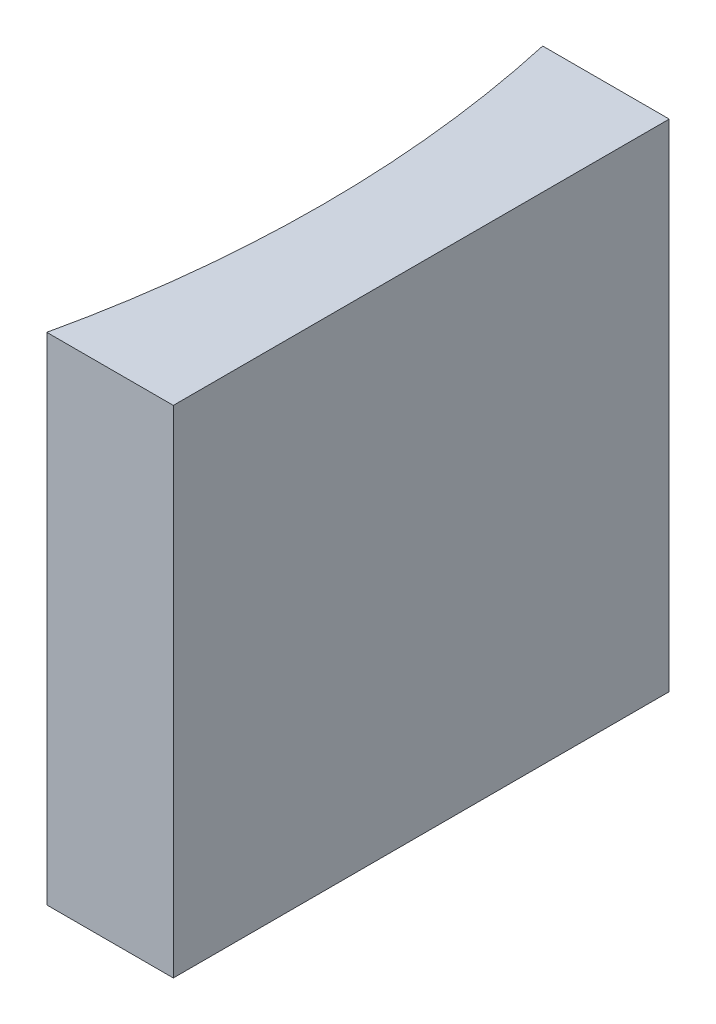
ISO-10303-21;
HEADER;
FILE_DESCRIPTION(('STEP AP214'),'2;1');
FILE_NAME('part.step','',(''),(''),'','','');
FILE_SCHEMA(('AUTOMOTIVE_DESIGN { 1 0 10303 214 1 1 1 1 }'));
ENDSEC;
DATA;
#1=APPLICATION_CONTEXT('core data for automotive mechanical design processes');
#2=APPLICATION_PROTOCOL_DEFINITION('international standard','automotive_design',2000,#1);
#3=PRODUCT_CONTEXT('',#1,'mechanical');
#4=PRODUCT('Part','Part','',(#3));
#5=PRODUCT_RELATED_PRODUCT_CATEGORY('part','',(#4));
#6=PRODUCT_DEFINITION_FORMATION('','',#4);
#7=PRODUCT_DEFINITION_CONTEXT('part definition',#1,'design');
#8=PRODUCT_DEFINITION('design','',#6,#7);
#9=PRODUCT_DEFINITION_SHAPE('','',#8);
#10=(LENGTH_UNIT() NAMED_UNIT(*) SI_UNIT(.MILLI.,.METRE.));
#11=(NAMED_UNIT(*) PLANE_ANGLE_UNIT() SI_UNIT($,.RADIAN.));
#12=(NAMED_UNIT(*) SI_UNIT($,.STERADIAN.) SOLID_ANGLE_UNIT());
#13=UNCERTAINTY_MEASURE_WITH_UNIT(LENGTH_MEASURE(1.E-05),#10,'distance_accuracy_value','');
#14=(GEOMETRIC_REPRESENTATION_CONTEXT(3) GLOBAL_UNCERTAINTY_ASSIGNED_CONTEXT((#13)) GLOBAL_UNIT_ASSIGNED_CONTEXT((#10,
#11,#12)) REPRESENTATION_CONTEXT('',''));
#15=CARTESIAN_POINT('',(0.,0.,0.));
#16=DIRECTION('',(0.,0.,1.));
#17=DIRECTION('',(1.,0.,0.));
#18=AXIS2_PLACEMENT_3D('',#15,#16,#17);
#19=CARTESIAN_POINT('',(0.,10.,0.));
#20=DIRECTION('',(0.,0.,1.));
#21=DIRECTION('',(1.,0.,0.));
#22=AXIS2_PLACEMENT_3D('',#19,#20,#21);
#23=PLANE('',#22);
#24=DIRECTION('',(-1.,0.,0.));
#25=VECTOR('',#24,1.);
#26=CARTESIAN_POINT('',(0.,0.,0.));
#27=LINE('',#26,#25);
#28=CARTESIAN_POINT('',(0.,0.,0.));
#29=VERTEX_POINT('',#28);
#30=CARTESIAN_POINT('',(-2.55202288985435,0.,0.));
#31=VERTEX_POINT('',#30);
#32=EDGE_CURVE('E100',#29,#31,#27,.T.);
#33=ORIENTED_EDGE('',*,*,#32,.T.);
#34=DIRECTION('',(0.,-1.,0.));
#35=VECTOR('',#34,1.);
#36=CARTESIAN_POINT('',(-2.55202288985435,10.,0.));
#37=LINE('',#36,#35);
#38=CARTESIAN_POINT('',(-2.55202288985435,10.,0.));
#39=VERTEX_POINT('',#38);
#40=EDGE_CURVE('E11',#39,#31,#37,.T.);
#41=ORIENTED_EDGE('',*,*,#40,.F.);
#42=DIRECTION('',(-1.,0.,0.));
#43=VECTOR('',#42,1.);
#44=CARTESIAN_POINT('',(0.,10.,0.));
#45=LINE('',#44,#43);
#46=CARTESIAN_POINT('',(0.,10.,0.));
#47=VERTEX_POINT('',#46);
#48=EDGE_CURVE('E88',#47,#39,#45,.T.);
#49=ORIENTED_EDGE('',*,*,#48,.F.);
#50=DIRECTION('',(0.,-1.,0.));
#51=VECTOR('',#50,1.);
#52=CARTESIAN_POINT('',(0.,10.,0.));
#53=LINE('',#52,#51);
#54=EDGE_CURVE('E96',#47,#29,#53,.T.);
#55=ORIENTED_EDGE('',*,*,#54,.T.);
#56=EDGE_LOOP('',(#33,#41,#49,#55));
#57=FACE_BOUND('',#56,.T.);
#58=ADVANCED_FACE('F37',(#57),#23,.F.);
#59=CARTESIAN_POINT('',(-24.92,10.,5.));
#60=DIRECTION('',(0.,-1.,0.));
#61=DIRECTION('',(0.,0.,-1.));
#62=AXIS2_PLACEMENT_3D('',#59,#60,#61);
#63=CYLINDRICAL_SURFACE('',#62,22.92);
#64=CARTESIAN_POINT('',(-24.92,0.,5.));
#65=DIRECTION('',(0.,-1.,0.));
#66=DIRECTION('',(0.,0.,1.));
#67=AXIS2_PLACEMENT_3D('',#64,#65,#66);
#68=CIRCLE('',#67,22.92);
#69=CARTESIAN_POINT('',(-2.55202288985434,0.,10.));
#70=VERTEX_POINT('',#69);
#71=EDGE_CURVE('E92',#31,#70,#68,.T.);
#72=ORIENTED_EDGE('',*,*,#71,.T.);
#73=DIRECTION('',(0.,-1.,0.));
#74=VECTOR('',#73,1.);
#75=CARTESIAN_POINT('',(-2.55202288985434,10.,10.));
#76=LINE('',#75,#74);
#77=CARTESIAN_POINT('',(-2.55202288985434,10.,10.));
#78=VERTEX_POINT('',#77);
#79=EDGE_CURVE('E45',#78,#70,#76,.T.);
#80=ORIENTED_EDGE('',*,*,#79,.F.);
#81=CARTESIAN_POINT('',(-24.92,10.,5.));
#82=DIRECTION('',(0.,-1.,0.));
#83=DIRECTION('',(0.,0.,1.));
#84=AXIS2_PLACEMENT_3D('',#81,#82,#83);
#85=CIRCLE('',#84,22.92);
#86=EDGE_CURVE('E83',#39,#78,#85,.T.);
#87=ORIENTED_EDGE('',*,*,#86,.F.);
#88=ORIENTED_EDGE('',*,*,#40,.T.);
#89=EDGE_LOOP('',(#72,#80,#87,#88));
#90=FACE_BOUND('',#89,.T.);
#91=ADVANCED_FACE('F91',(#90),#63,.F.);
#92=CARTESIAN_POINT('',(0.,10.,10.));
#93=DIRECTION('',(0.,0.,-1.));
#94=DIRECTION('',(-1.,0.,0.));
#95=AXIS2_PLACEMENT_3D('',#92,#93,#94);
#96=PLANE('',#95);
#97=DIRECTION('',(1.,0.,0.));
#98=VECTOR('',#97,1.);
#99=CARTESIAN_POINT('',(0.,0.,10.));
#100=LINE('',#99,#98);
#101=CARTESIAN_POINT('',(0.,0.,10.));
#102=VERTEX_POINT('',#101);
#103=EDGE_CURVE('E70',#70,#102,#100,.T.);
#104=ORIENTED_EDGE('',*,*,#103,.T.);
#105=DIRECTION('',(0.,-1.,0.));
#106=VECTOR('',#105,1.);
#107=CARTESIAN_POINT('',(0.,10.,10.));
#108=LINE('',#107,#106);
#109=CARTESIAN_POINT('',(0.,10.,10.));
#110=VERTEX_POINT('',#109);
#111=EDGE_CURVE('E93',#110,#102,#108,.T.);
#112=ORIENTED_EDGE('',*,*,#111,.F.);
#113=DIRECTION('',(1.,0.,0.));
#114=VECTOR('',#113,1.);
#115=CARTESIAN_POINT('',(0.,10.,10.));
#116=LINE('',#115,#114);
#117=EDGE_CURVE('E86',#78,#110,#116,.T.);
#118=ORIENTED_EDGE('',*,*,#117,.F.);
#119=ORIENTED_EDGE('',*,*,#79,.T.);
#120=EDGE_LOOP('',(#104,#112,#118,#119));
#121=FACE_BOUND('',#120,.T.);
#122=ADVANCED_FACE('F94',(#121),#96,.F.);
#123=CARTESIAN_POINT('',(0.,10.,0.));
#124=DIRECTION('',(-1.,0.,0.));
#125=DIRECTION('',(0.,0.,1.));
#126=AXIS2_PLACEMENT_3D('',#123,#124,#125);
#127=PLANE('',#126);
#128=DIRECTION('',(0.,0.,-1.));
#129=VECTOR('',#128,1.);
#130=CARTESIAN_POINT('',(0.,0.,0.));
#131=LINE('',#130,#129);
#132=EDGE_CURVE('E76',#102,#29,#131,.T.);
#133=ORIENTED_EDGE('',*,*,#132,.T.);
#134=ORIENTED_EDGE('',*,*,#54,.F.);
#135=DIRECTION('',(0.,0.,-1.));
#136=VECTOR('',#135,1.);
#137=CARTESIAN_POINT('',(0.,10.,0.));
#138=LINE('',#137,#136);
#139=EDGE_CURVE('E53',#110,#47,#138,.T.);
#140=ORIENTED_EDGE('',*,*,#139,.F.);
#141=ORIENTED_EDGE('',*,*,#111,.T.);
#142=EDGE_LOOP('',(#133,#134,#140,#141));
#143=FACE_BOUND('',#142,.T.);
#144=ADVANCED_FACE('F107',(#143),#127,.F.);
#145=CARTESIAN_POINT('',(-24.92,10.,5.));
#146=DIRECTION('',(0.,1.,0.));
#147=DIRECTION('',(0.,0.,1.));
#148=AXIS2_PLACEMENT_3D('',#145,#146,#147);
#149=PLANE('',#148);
#150=ORIENTED_EDGE('',*,*,#48,.T.);
#151=ORIENTED_EDGE('',*,*,#86,.T.);
#152=ORIENTED_EDGE('',*,*,#117,.T.);
#153=ORIENTED_EDGE('',*,*,#139,.T.);
#154=EDGE_LOOP('',(#150,#151,#152,#153));
#155=FACE_BOUND('',#154,.T.);
#156=ADVANCED_FACE('F84',(#155),#149,.T.);
#157=CARTESIAN_POINT('',(-24.92,0.,5.));
#158=DIRECTION('',(0.,1.,0.));
#159=DIRECTION('',(0.,0.,1.));
#160=AXIS2_PLACEMENT_3D('',#157,#158,#159);
#161=PLANE('',#160);
#162=ORIENTED_EDGE('',*,*,#32,.F.);
#163=ORIENTED_EDGE('',*,*,#132,.F.);
#164=ORIENTED_EDGE('',*,*,#103,.F.);
#165=ORIENTED_EDGE('',*,*,#71,.F.);
#166=EDGE_LOOP('',(#162,#163,#164,#165));
#167=FACE_BOUND('',#166,.T.);
#168=ADVANCED_FACE('F110',(#167),#161,.F.);
#169=CLOSED_SHELL('',(#58,#91,#122,#144,#156,#168));
#170=MANIFOLD_SOLID_BREP('B2',#169);
#171=ADVANCED_BREP_SHAPE_REPRESENTATION('',(#18,#170),#14);
#172=SHAPE_DEFINITION_REPRESENTATION(#9,#171);
ENDSEC;
END-ISO-10303-21;
